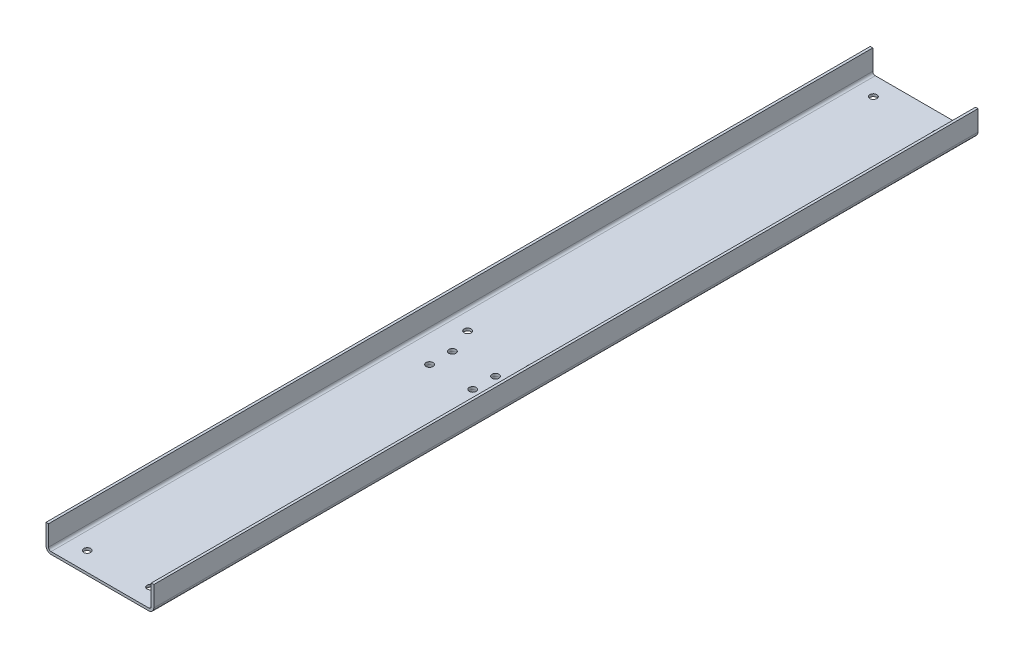
ISO-10303-21;
HEADER;
FILE_DESCRIPTION(('STEP AP214'),'2;1');
FILE_NAME('part.step','',(''),(''),'','','');
FILE_SCHEMA(('AUTOMOTIVE_DESIGN { 1 0 10303 214 1 1 1 1 }'));
ENDSEC;
DATA;
#1=APPLICATION_CONTEXT('core data for automotive mechanical design processes');
#2=APPLICATION_PROTOCOL_DEFINITION('international standard','automotive_design',2000,#1);
#3=PRODUCT_CONTEXT('',#1,'mechanical');
#4=PRODUCT('Part','Part','',(#3));
#5=PRODUCT_RELATED_PRODUCT_CATEGORY('part','',(#4));
#6=PRODUCT_DEFINITION_FORMATION('','',#4);
#7=PRODUCT_DEFINITION_CONTEXT('part definition',#1,'design');
#8=PRODUCT_DEFINITION('design','',#6,#7);
#9=PRODUCT_DEFINITION_SHAPE('','',#8);
#10=(LENGTH_UNIT() NAMED_UNIT(*) SI_UNIT(.MILLI.,.METRE.));
#11=(NAMED_UNIT(*) PLANE_ANGLE_UNIT() SI_UNIT($,.RADIAN.));
#12=(NAMED_UNIT(*) SI_UNIT($,.STERADIAN.) SOLID_ANGLE_UNIT());
#13=UNCERTAINTY_MEASURE_WITH_UNIT(LENGTH_MEASURE(1.E-05),#10,'distance_accuracy_value','');
#14=(GEOMETRIC_REPRESENTATION_CONTEXT(3) GLOBAL_UNCERTAINTY_ASSIGNED_CONTEXT((#13)) GLOBAL_UNIT_ASSIGNED_CONTEXT((#10,
#11,#12)) REPRESENTATION_CONTEXT('',''));
#15=CARTESIAN_POINT('',(0.,0.,0.));
#16=DIRECTION('',(0.,0.,1.));
#17=DIRECTION('',(1.,0.,0.));
#18=AXIS2_PLACEMENT_3D('',#15,#16,#17);
#19=CARTESIAN_POINT('',(23.,-6.,379.));
#20=DIRECTION('',(-1.,0.,0.));
#21=DIRECTION('',(0.,-1.,0.));
#22=AXIS2_PLACEMENT_3D('',#19,#20,#21);
#23=PLANE('',#22);
#24=DIRECTION('',(0.,0.,1.));
#25=VECTOR('',#24,1.);
#26=CARTESIAN_POINT('',(23.,-6.,379.));
#27=LINE('',#26,#25);
#28=CARTESIAN_POINT('',(23.,-6.,352.));
#29=VERTEX_POINT('',#28);
#30=CARTESIAN_POINT('',(23.,-6.,376.));
#31=VERTEX_POINT('',#30);
#32=EDGE_CURVE('E143',#29,#31,#27,.T.);
#33=ORIENTED_EDGE('',*,*,#32,.F.);
#34=DIRECTION('',(0.,1.,0.));
#35=VECTOR('',#34,1.);
#36=CARTESIAN_POINT('',(23.,-6.,352.));
#37=LINE('',#36,#35);
#38=CARTESIAN_POINT('',(23.,0.,352.));
#39=VERTEX_POINT('',#38);
#40=EDGE_CURVE('E12',#29,#39,#37,.T.);
#41=ORIENTED_EDGE('',*,*,#40,.T.);
#42=DIRECTION('',(0.,0.,1.));
#43=VECTOR('',#42,1.);
#44=CARTESIAN_POINT('',(23.,0.,379.));
#45=LINE('',#44,#43);
#46=CARTESIAN_POINT('',(23.,0.,376.));
#47=VERTEX_POINT('',#46);
#48=EDGE_CURVE('E194',#39,#47,#45,.T.);
#49=ORIENTED_EDGE('',*,*,#48,.T.);
#50=DIRECTION('',(0.,-1.,0.));
#51=VECTOR('',#50,1.);
#52=CARTESIAN_POINT('',(23.,-6.,376.));
#53=LINE('',#52,#51);
#54=EDGE_CURVE('E56',#47,#31,#53,.T.);
#55=ORIENTED_EDGE('',*,*,#54,.T.);
#56=EDGE_LOOP('',(#33,#41,#49,#55));
#57=FACE_BOUND('',#56,.T.);
#58=ADVANCED_FACE('F47',(#57),#23,.F.);
#59=CARTESIAN_POINT('',(23.,-6.,379.));
#60=DIRECTION('',(0.,0.,-1.));
#61=DIRECTION('',(-1.,0.,0.));
#62=AXIS2_PLACEMENT_3D('',#59,#60,#61);
#63=PLANE('',#62);
#64=DIRECTION('',(-1.,0.,0.));
#65=VECTOR('',#64,1.);
#66=CARTESIAN_POINT('',(23.,0.,379.));
#67=LINE('',#66,#65);
#68=CARTESIAN_POINT('',(20.,0.,379.));
#69=VERTEX_POINT('',#68);
#70=CARTESIAN_POINT('',(-20.,0.,379.));
#71=VERTEX_POINT('',#70);
#72=EDGE_CURVE('E148',#69,#71,#67,.T.);
#73=ORIENTED_EDGE('',*,*,#72,.T.);
#74=DIRECTION('',(0.,-1.,0.));
#75=VECTOR('',#74,1.);
#76=CARTESIAN_POINT('',(-20.,-6.,379.));
#77=LINE('',#76,#75);
#78=CARTESIAN_POINT('',(-20.,-6.,379.));
#79=VERTEX_POINT('',#78);
#80=EDGE_CURVE('E64',#71,#79,#77,.T.);
#81=ORIENTED_EDGE('',*,*,#80,.T.);
#82=DIRECTION('',(-1.,0.,0.));
#83=VECTOR('',#82,1.);
#84=CARTESIAN_POINT('',(23.,-6.,379.));
#85=LINE('',#84,#83);
#86=CARTESIAN_POINT('',(20.,-6.,379.));
#87=VERTEX_POINT('',#86);
#88=EDGE_CURVE('E146',#87,#79,#85,.T.);
#89=ORIENTED_EDGE('',*,*,#88,.F.);
#90=DIRECTION('',(0.,1.,0.));
#91=VECTOR('',#90,1.);
#92=CARTESIAN_POINT('',(20.,-6.,379.));
#93=LINE('',#92,#91);
#94=EDGE_CURVE('E166',#87,#69,#93,.T.);
#95=ORIENTED_EDGE('',*,*,#94,.T.);
#96=EDGE_LOOP('',(#73,#81,#89,#95));
#97=FACE_BOUND('',#96,.T.);
#98=ADVANCED_FACE('F203',(#97),#63,.F.);
#99=CARTESIAN_POINT('',(-23.,-6.,379.));
#100=DIRECTION('',(1.,0.,0.));
#101=DIRECTION('',(0.,0.,-1.));
#102=AXIS2_PLACEMENT_3D('',#99,#100,#101);
#103=PLANE('',#102);
#104=DIRECTION('',(0.,0.,-1.));
#105=VECTOR('',#104,1.);
#106=CARTESIAN_POINT('',(-23.,0.,379.));
#107=LINE('',#106,#105);
#108=CARTESIAN_POINT('',(-23.,0.,376.));
#109=VERTEX_POINT('',#108);
#110=CARTESIAN_POINT('',(-23.,0.,352.));
#111=VERTEX_POINT('',#110);
#112=EDGE_CURVE('E144',#109,#111,#107,.T.);
#113=ORIENTED_EDGE('',*,*,#112,.T.);
#114=DIRECTION('',(0.,-1.,0.));
#115=VECTOR('',#114,1.);
#116=CARTESIAN_POINT('',(-23.,-6.,352.));
#117=LINE('',#116,#115);
#118=CARTESIAN_POINT('',(-23.,-6.,352.));
#119=VERTEX_POINT('',#118);
#120=EDGE_CURVE('E121',#111,#119,#117,.T.);
#121=ORIENTED_EDGE('',*,*,#120,.T.);
#122=DIRECTION('',(0.,0.,-1.));
#123=VECTOR('',#122,1.);
#124=CARTESIAN_POINT('',(-23.,-6.,379.));
#125=LINE('',#124,#123);
#126=CARTESIAN_POINT('',(-23.,-6.,376.));
#127=VERTEX_POINT('',#126);
#128=EDGE_CURVE('E197',#127,#119,#125,.T.);
#129=ORIENTED_EDGE('',*,*,#128,.F.);
#130=DIRECTION('',(0.,1.,0.));
#131=VECTOR('',#130,1.);
#132=CARTESIAN_POINT('',(-23.,-6.,376.));
#133=LINE('',#132,#131);
#134=EDGE_CURVE('E126',#127,#109,#133,.T.);
#135=ORIENTED_EDGE('',*,*,#134,.T.);
#136=EDGE_LOOP('',(#113,#121,#129,#135));
#137=FACE_BOUND('',#136,.T.);
#138=ADVANCED_FACE('F212',(#137),#103,.F.);
#139=CARTESIAN_POINT('',(23.,-6.,349.));
#140=DIRECTION('',(0.,0.,1.));
#141=DIRECTION('',(1.,0.,0.));
#142=AXIS2_PLACEMENT_3D('',#139,#140,#141);
#143=PLANE('',#142);
#144=DIRECTION('',(1.,0.,0.));
#145=VECTOR('',#144,1.);
#146=CARTESIAN_POINT('',(23.,-6.,349.));
#147=LINE('',#146,#145);
#148=CARTESIAN_POINT('',(-20.,-6.,349.));
#149=VERTEX_POINT('',#148);
#150=CARTESIAN_POINT('',(20.,-6.,349.));
#151=VERTEX_POINT('',#150);
#152=EDGE_CURVE('E136',#149,#151,#147,.T.);
#153=ORIENTED_EDGE('',*,*,#152,.F.);
#154=DIRECTION('',(0.,1.,0.));
#155=VECTOR('',#154,1.);
#156=CARTESIAN_POINT('',(-20.,-6.,349.));
#157=LINE('',#156,#155);
#158=CARTESIAN_POINT('',(-20.,0.,349.));
#159=VERTEX_POINT('',#158);
#160=EDGE_CURVE('E120',#149,#159,#157,.T.);
#161=ORIENTED_EDGE('',*,*,#160,.T.);
#162=DIRECTION('',(1.,0.,0.));
#163=VECTOR('',#162,1.);
#164=CARTESIAN_POINT('',(23.,0.,349.));
#165=LINE('',#164,#163);
#166=CARTESIAN_POINT('',(20.,0.,349.));
#167=VERTEX_POINT('',#166);
#168=EDGE_CURVE('E133',#159,#167,#165,.T.);
#169=ORIENTED_EDGE('',*,*,#168,.T.);
#170=DIRECTION('',(0.,-1.,0.));
#171=VECTOR('',#170,1.);
#172=CARTESIAN_POINT('',(20.,-6.,349.));
#173=LINE('',#172,#171);
#174=EDGE_CURVE('E138',#167,#151,#173,.T.);
#175=ORIENTED_EDGE('',*,*,#174,.T.);
#176=EDGE_LOOP('',(#153,#161,#169,#175));
#177=FACE_BOUND('',#176,.T.);
#178=ADVANCED_FACE('F132',(#177),#143,.F.);
#179=CARTESIAN_POINT('',(23.,-6.,349.));
#180=DIRECTION('',(0.,1.,0.));
#181=DIRECTION('',(-1.,0.,0.));
#182=AXIS2_PLACEMENT_3D('',#179,#180,#181);
#183=PLANE('',#182);
#184=CARTESIAN_POINT('',(17.,-6.,355.));
#185=DIRECTION('',(0.,1.,0.));
#186=DIRECTION('',(0.,0.,1.));
#187=AXIS2_PLACEMENT_3D('',#184,#185,#186);
#188=CIRCLE('',#187,2.75);
#189=CARTESIAN_POINT('',(17.,-6.,357.75));
#190=VERTEX_POINT('',#189);
#191=EDGE_CURVE('E184',#190,#190,#188,.T.);
#192=ORIENTED_EDGE('',*,*,#191,.T.);
#193=EDGE_LOOP('',(#192));
#194=FACE_BOUND('',#193,.T.);
#195=CARTESIAN_POINT('',(-17.,-6.00000000000001,355.));
#196=DIRECTION('',(0.,1.,0.));
#197=DIRECTION('',(0.,0.,1.));
#198=AXIS2_PLACEMENT_3D('',#195,#196,#197);
#199=CIRCLE('',#198,2.75);
#200=CARTESIAN_POINT('',(-17.,-6.00000000000001,357.75));
#201=VERTEX_POINT('',#200);
#202=EDGE_CURVE('E173',#201,#201,#199,.T.);
#203=ORIENTED_EDGE('',*,*,#202,.T.);
#204=EDGE_LOOP('',(#203));
#205=FACE_BOUND('',#204,.T.);
#206=CARTESIAN_POINT('',(-17.,-6.00000000000001,373.));
#207=DIRECTION('',(0.,1.,0.));
#208=DIRECTION('',(0.,0.,1.));
#209=AXIS2_PLACEMENT_3D('',#206,#207,#208);
#210=CIRCLE('',#209,2.75);
#211=CARTESIAN_POINT('',(-17.,-6.00000000000001,375.75));
#212=VERTEX_POINT('',#211);
#213=EDGE_CURVE('E172',#212,#212,#210,.T.);
#214=ORIENTED_EDGE('',*,*,#213,.T.);
#215=EDGE_LOOP('',(#214));
#216=FACE_BOUND('',#215,.T.);
#217=CARTESIAN_POINT('',(17.,-6.,373.));
#218=DIRECTION('',(0.,1.,0.));
#219=DIRECTION('',(0.,0.,1.));
#220=AXIS2_PLACEMENT_3D('',#217,#218,#219);
#221=CIRCLE('',#220,2.75);
#222=CARTESIAN_POINT('',(17.,-6.,375.75));
#223=VERTEX_POINT('',#222);
#224=EDGE_CURVE('E189',#223,#223,#221,.T.);
#225=ORIENTED_EDGE('',*,*,#224,.T.);
#226=EDGE_LOOP('',(#225));
#227=FACE_BOUND('',#226,.T.);
#228=ORIENTED_EDGE('',*,*,#128,.T.);
#229=DIRECTION('',(-0.707106781186543,0.,0.707106781186552));
#230=VECTOR('',#229,1.);
#231=CARTESIAN_POINT('',(-20.,-6.,349.));
#232=LINE('',#231,#230);
#233=EDGE_CURVE('E164',#119,#149,#232,.F.);
#234=ORIENTED_EDGE('',*,*,#233,.T.);
#235=ORIENTED_EDGE('',*,*,#152,.T.);
#236=DIRECTION('',(-0.707106781186545,0.,-0.70710678118655));
#237=VECTOR('',#236,1.);
#238=CARTESIAN_POINT('',(23.,-6.,352.));
#239=LINE('',#238,#237);
#240=EDGE_CURVE('E160',#151,#29,#239,.F.);
#241=ORIENTED_EDGE('',*,*,#240,.T.);
#242=ORIENTED_EDGE('',*,*,#32,.T.);
#243=DIRECTION('',(0.707106781186548,0.,-0.707106781186547));
#244=VECTOR('',#243,1.);
#245=CARTESIAN_POINT('',(20.,-6.,379.));
#246=LINE('',#245,#244);
#247=EDGE_CURVE('E71',#31,#87,#246,.F.);
#248=ORIENTED_EDGE('',*,*,#247,.T.);
#249=ORIENTED_EDGE('',*,*,#88,.T.);
#250=DIRECTION('',(0.707106781186545,0.,0.70710678118655));
#251=VECTOR('',#250,1.);
#252=CARTESIAN_POINT('',(-23.,-6.,376.));
#253=LINE('',#252,#251);
#254=EDGE_CURVE('E162',#79,#127,#253,.F.);
#255=ORIENTED_EDGE('',*,*,#254,.T.);
#256=EDGE_LOOP('',(#228,#234,#235,#241,#242,#248,#249,#255));
#257=FACE_BOUND('',#256,.T.);
#258=ADVANCED_FACE('F210',(#194,#205,#216,#227,#257),#183,.F.);
#259=CARTESIAN_POINT('',(23.,0.,349.));
#260=DIRECTION('',(0.,1.,0.));
#261=DIRECTION('',(-1.,0.,0.));
#262=AXIS2_PLACEMENT_3D('',#259,#260,#261);
#263=PLANE('',#262);
#264=CARTESIAN_POINT('',(17.,0.,355.));
#265=DIRECTION('',(0.,1.,0.));
#266=DIRECTION('',(-1.,0.,0.));
#267=AXIS2_PLACEMENT_3D('',#264,#265,#266);
#268=CIRCLE('',#267,2.74999999999999);
#269=CARTESIAN_POINT('',(14.25,0.,355.));
#270=VERTEX_POINT('',#269);
#271=EDGE_CURVE('E51',#270,#270,#268,.T.);
#272=ORIENTED_EDGE('',*,*,#271,.F.);
#273=EDGE_LOOP('',(#272));
#274=FACE_BOUND('',#273,.T.);
#275=CARTESIAN_POINT('',(-17.,0.,355.));
#276=DIRECTION('',(0.,1.,0.));
#277=DIRECTION('',(-1.,0.,0.));
#278=AXIS2_PLACEMENT_3D('',#275,#276,#277);
#279=CIRCLE('',#278,2.74999999999999);
#280=CARTESIAN_POINT('',(-19.75,0.,355.));
#281=VERTEX_POINT('',#280);
#282=EDGE_CURVE('E170',#281,#281,#279,.T.);
#283=ORIENTED_EDGE('',*,*,#282,.F.);
#284=EDGE_LOOP('',(#283));
#285=FACE_BOUND('',#284,.T.);
#286=CARTESIAN_POINT('',(-17.,0.,373.));
#287=DIRECTION('',(0.,1.,0.));
#288=DIRECTION('',(-1.,0.,0.));
#289=AXIS2_PLACEMENT_3D('',#286,#287,#288);
#290=CIRCLE('',#289,2.74999999999999);
#291=CARTESIAN_POINT('',(-19.75,0.,373.));
#292=VERTEX_POINT('',#291);
#293=EDGE_CURVE('E177',#292,#292,#290,.T.);
#294=ORIENTED_EDGE('',*,*,#293,.F.);
#295=EDGE_LOOP('',(#294));
#296=FACE_BOUND('',#295,.T.);
#297=CARTESIAN_POINT('',(17.,0.,373.));
#298=DIRECTION('',(0.,1.,0.));
#299=DIRECTION('',(-1.,0.,0.));
#300=AXIS2_PLACEMENT_3D('',#297,#298,#299);
#301=CIRCLE('',#300,2.74999999999999);
#302=CARTESIAN_POINT('',(14.25,0.,373.));
#303=VERTEX_POINT('',#302);
#304=EDGE_CURVE('E192',#303,#303,#301,.T.);
#305=ORIENTED_EDGE('',*,*,#304,.F.);
#306=EDGE_LOOP('',(#305));
#307=FACE_BOUND('',#306,.T.);
#308=ORIENTED_EDGE('',*,*,#168,.F.);
#309=DIRECTION('',(0.707106781186543,0.,-0.707106781186552));
#310=VECTOR('',#309,1.);
#311=CARTESIAN_POINT('',(1.49999999999974,0.,327.5));
#312=LINE('',#311,#310);
#313=EDGE_CURVE('E116',#159,#111,#312,.F.);
#314=ORIENTED_EDGE('',*,*,#313,.T.);
#315=ORIENTED_EDGE('',*,*,#112,.F.);
#316=DIRECTION('',(-0.707106781186545,0.,-0.70710678118655));
#317=VECTOR('',#316,1.);
#318=CARTESIAN_POINT('',(-13.5000000000001,0.,385.5));
#319=LINE('',#318,#317);
#320=EDGE_CURVE('E127',#109,#71,#319,.F.);
#321=ORIENTED_EDGE('',*,*,#320,.T.);
#322=ORIENTED_EDGE('',*,*,#72,.F.);
#323=DIRECTION('',(-0.707106781186548,0.,0.707106781186547));
#324=VECTOR('',#323,1.);
#325=CARTESIAN_POINT('',(36.5,0.,362.5));
#326=LINE('',#325,#324);
#327=EDGE_CURVE('E137',#69,#47,#326,.F.);
#328=ORIENTED_EDGE('',*,*,#327,.T.);
#329=ORIENTED_EDGE('',*,*,#48,.F.);
#330=DIRECTION('',(0.707106781186545,0.,0.70710678118655));
#331=VECTOR('',#330,1.);
#332=CARTESIAN_POINT('',(21.5,0.,350.5));
#333=LINE('',#332,#331);
#334=EDGE_CURVE('E142',#39,#167,#333,.F.);
#335=ORIENTED_EDGE('',*,*,#334,.T.);
#336=EDGE_LOOP('',(#308,#314,#315,#321,#322,#328,#329,#335));
#337=FACE_BOUND('',#336,.T.);
#338=ADVANCED_FACE('F140',(#274,#285,#296,#307,#337),#263,.T.);
#339=CARTESIAN_POINT('',(-20.,-6.,349.));
#340=DIRECTION('',(0.707106781186552,0.,0.707106781186543));
#341=DIRECTION('',(0.707106781186543,0.,-0.707106781186552));
#342=AXIS2_PLACEMENT_3D('',#339,#340,#341);
#343=PLANE('',#342);
#344=ORIENTED_EDGE('',*,*,#233,.F.);
#345=ORIENTED_EDGE('',*,*,#120,.F.);
#346=ORIENTED_EDGE('',*,*,#313,.F.);
#347=ORIENTED_EDGE('',*,*,#160,.F.);
#348=EDGE_LOOP('',(#344,#345,#346,#347));
#349=FACE_BOUND('',#348,.T.);
#350=ADVANCED_FACE('F119',(#349),#343,.F.);
#351=CARTESIAN_POINT('',(-23.,-6.,376.));
#352=DIRECTION('',(0.70710678118655,0.,-0.707106781186545));
#353=DIRECTION('',(-0.707106781186545,0.,-0.70710678118655));
#354=AXIS2_PLACEMENT_3D('',#351,#352,#353);
#355=PLANE('',#354);
#356=ORIENTED_EDGE('',*,*,#254,.F.);
#357=ORIENTED_EDGE('',*,*,#80,.F.);
#358=ORIENTED_EDGE('',*,*,#320,.F.);
#359=ORIENTED_EDGE('',*,*,#134,.F.);
#360=EDGE_LOOP('',(#356,#357,#358,#359));
#361=FACE_BOUND('',#360,.T.);
#362=ADVANCED_FACE('F207',(#361),#355,.F.);
#363=CARTESIAN_POINT('',(23.,-6.,352.));
#364=DIRECTION('',(-0.70710678118655,0.,0.707106781186545));
#365=DIRECTION('',(0.707106781186545,0.,0.70710678118655));
#366=AXIS2_PLACEMENT_3D('',#363,#364,#365);
#367=PLANE('',#366);
#368=ORIENTED_EDGE('',*,*,#240,.F.);
#369=ORIENTED_EDGE('',*,*,#174,.F.);
#370=ORIENTED_EDGE('',*,*,#334,.F.);
#371=ORIENTED_EDGE('',*,*,#40,.F.);
#372=EDGE_LOOP('',(#368,#369,#370,#371));
#373=FACE_BOUND('',#372,.T.);
#374=ADVANCED_FACE('F231',(#373),#367,.F.);
#375=CARTESIAN_POINT('',(20.,-6.,379.));
#376=DIRECTION('',(-0.707106781186547,0.,-0.707106781186548));
#377=DIRECTION('',(-0.707106781186548,0.,0.707106781186547));
#378=AXIS2_PLACEMENT_3D('',#375,#376,#377);
#379=PLANE('',#378);
#380=ORIENTED_EDGE('',*,*,#247,.F.);
#381=ORIENTED_EDGE('',*,*,#54,.F.);
#382=ORIENTED_EDGE('',*,*,#327,.F.);
#383=ORIENTED_EDGE('',*,*,#94,.F.);
#384=EDGE_LOOP('',(#380,#381,#382,#383));
#385=FACE_BOUND('',#384,.T.);
#386=ADVANCED_FACE('F49',(#385),#379,.F.);
#387=CARTESIAN_POINT('',(17.,2.00000000000001,373.));
#388=DIRECTION('',(0.,1.,0.));
#389=DIRECTION('',(0.,0.,1.));
#390=AXIS2_PLACEMENT_3D('',#387,#388,#389);
#391=CYLINDRICAL_SURFACE('',#390,2.74999999999999);
#392=ORIENTED_EDGE('',*,*,#304,.T.);
#393=EDGE_LOOP('',(#392));
#394=FACE_BOUND('',#393,.T.);
#395=ORIENTED_EDGE('',*,*,#224,.F.);
#396=EDGE_LOOP('',(#395));
#397=FACE_BOUND('',#396,.T.);
#398=ADVANCED_FACE('F237',(#394,#397),#391,.F.);
#399=CARTESIAN_POINT('',(-17.,2.,373.));
#400=DIRECTION('',(0.,1.,0.));
#401=DIRECTION('',(0.,0.,1.));
#402=AXIS2_PLACEMENT_3D('',#399,#400,#401);
#403=CYLINDRICAL_SURFACE('',#402,2.74999999999999);
#404=ORIENTED_EDGE('',*,*,#293,.T.);
#405=EDGE_LOOP('',(#404));
#406=FACE_BOUND('',#405,.T.);
#407=ORIENTED_EDGE('',*,*,#213,.F.);
#408=EDGE_LOOP('',(#407));
#409=FACE_BOUND('',#408,.T.);
#410=ADVANCED_FACE('F246',(#406,#409),#403,.F.);
#411=CARTESIAN_POINT('',(-17.,2.,355.));
#412=DIRECTION('',(0.,1.,0.));
#413=DIRECTION('',(0.,0.,1.));
#414=AXIS2_PLACEMENT_3D('',#411,#412,#413);
#415=CYLINDRICAL_SURFACE('',#414,2.74999999999999);
#416=ORIENTED_EDGE('',*,*,#282,.T.);
#417=EDGE_LOOP('',(#416));
#418=FACE_BOUND('',#417,.T.);
#419=ORIENTED_EDGE('',*,*,#202,.F.);
#420=EDGE_LOOP('',(#419));
#421=FACE_BOUND('',#420,.T.);
#422=ADVANCED_FACE('F253',(#418,#421),#415,.F.);
#423=CARTESIAN_POINT('',(17.,2.00000000000001,355.));
#424=DIRECTION('',(0.,1.,0.));
#425=DIRECTION('',(0.,0.,1.));
#426=AXIS2_PLACEMENT_3D('',#423,#424,#425);
#427=CYLINDRICAL_SURFACE('',#426,2.74999999999999);
#428=ORIENTED_EDGE('',*,*,#271,.T.);
#429=EDGE_LOOP('',(#428));
#430=FACE_BOUND('',#429,.T.);
#431=ORIENTED_EDGE('',*,*,#191,.F.);
#432=EDGE_LOOP('',(#431));
#433=FACE_BOUND('',#432,.T.);
#434=ADVANCED_FACE('F276',(#430,#433),#427,.F.);
#435=CLOSED_SHELL('',(#58,#98,#138,#178,#258,#338,#350,#362,#374,#386,#398,#410,#422,#434));
#436=MANIFOLD_SOLID_BREP('B2',#435);
#437=CARTESIAN_POINT('',(42.5,0.,650.));
#438=DIRECTION('',(-1.,0.,0.));
#439=DIRECTION('',(0.,-1.,0.));
#440=AXIS2_PLACEMENT_3D('',#437,#438,#439);
#441=PLANE('',#440);
#442=DIRECTION('',(0.,1.,0.));
#443=VECTOR('',#442,1.);
#444=CARTESIAN_POINT('',(42.5,0.,650.));
#445=LINE('',#444,#443);
#446=CARTESIAN_POINT('',(42.5,4.00000000000001,650.));
#447=VERTEX_POINT('',#446);
#448=CARTESIAN_POINT('',(42.5,20.,650.));
#449=VERTEX_POINT('',#448);
#450=EDGE_CURVE('E423',#447,#449,#445,.T.);
#451=ORIENTED_EDGE('',*,*,#450,.F.);
#452=DIRECTION('',(0.,0.,-1.));
#453=VECTOR('',#452,1.);
#454=CARTESIAN_POINT('',(42.5,4.00000000000001,650.));
#455=LINE('',#454,#453);
#456=CARTESIAN_POINT('',(42.5,4.00000000000001,0.));
#457=VERTEX_POINT('',#456);
#458=EDGE_CURVE('E471',#447,#457,#455,.T.);
#459=ORIENTED_EDGE('',*,*,#458,.T.);
#460=DIRECTION('',(0.,1.,0.));
#461=VECTOR('',#460,1.);
#462=CARTESIAN_POINT('',(42.5,0.,0.));
#463=LINE('',#462,#461);
#464=CARTESIAN_POINT('',(42.5,20.,0.));
#465=VERTEX_POINT('',#464);
#466=EDGE_CURVE('E446',#457,#465,#463,.T.);
#467=ORIENTED_EDGE('',*,*,#466,.T.);
#468=DIRECTION('',(0.,0.,-1.));
#469=VECTOR('',#468,1.);
#470=CARTESIAN_POINT('',(42.5,20.,650.));
#471=LINE('',#470,#469);
#472=EDGE_CURVE('E439',#449,#465,#471,.T.);
#473=ORIENTED_EDGE('',*,*,#472,.F.);
#474=EDGE_LOOP('',(#451,#459,#467,#473));
#475=FACE_BOUND('',#474,.T.);
#476=ADVANCED_FACE('F331',(#475),#441,.F.);
#477=CARTESIAN_POINT('',(40.5,20.,650.));
#478=DIRECTION('',(0.,-1.,0.));
#479=DIRECTION('',(1.,0.,0.));
#480=AXIS2_PLACEMENT_3D('',#477,#478,#479);
#481=PLANE('',#480);
#482=DIRECTION('',(-1.,0.,0.));
#483=VECTOR('',#482,1.);
#484=CARTESIAN_POINT('',(40.5,20.,0.));
#485=LINE('',#484,#483);
#486=CARTESIAN_POINT('',(40.5,20.,0.));
#487=VERTEX_POINT('',#486);
#488=EDGE_CURVE('E554',#465,#487,#485,.T.);
#489=ORIENTED_EDGE('',*,*,#488,.T.);
#490=DIRECTION('',(0.,0.,-1.));
#491=VECTOR('',#490,1.);
#492=CARTESIAN_POINT('',(40.5,20.,650.));
#493=LINE('',#492,#491);
#494=CARTESIAN_POINT('',(40.5,20.,650.));
#495=VERTEX_POINT('',#494);
#496=EDGE_CURVE('E441',#495,#487,#493,.T.);
#497=ORIENTED_EDGE('',*,*,#496,.F.);
#498=DIRECTION('',(-1.,0.,0.));
#499=VECTOR('',#498,1.);
#500=CARTESIAN_POINT('',(40.5,20.,650.));
#501=LINE('',#500,#499);
#502=EDGE_CURVE('E427',#449,#495,#501,.T.);
#503=ORIENTED_EDGE('',*,*,#502,.F.);
#504=ORIENTED_EDGE('',*,*,#472,.T.);
#505=EDGE_LOOP('',(#489,#497,#503,#504));
#506=FACE_BOUND('',#505,.T.);
#507=ADVANCED_FACE('F438',(#506),#481,.F.);
#508=CARTESIAN_POINT('',(40.5,2.00000000000001,650.));
#509=DIRECTION('',(1.,0.,0.));
#510=DIRECTION('',(0.,0.,-1.));
#511=AXIS2_PLACEMENT_3D('',#508,#509,#510);
#512=PLANE('',#511);
#513=DIRECTION('',(0.,-1.,0.));
#514=VECTOR('',#513,1.);
#515=CARTESIAN_POINT('',(40.5,2.00000000000001,0.));
#516=LINE('',#515,#514);
#517=CARTESIAN_POINT('',(40.5,4.00000000000001,0.));
#518=VERTEX_POINT('',#517);
#519=EDGE_CURVE('E556',#487,#518,#516,.T.);
#520=ORIENTED_EDGE('',*,*,#519,.T.);
#521=DIRECTION('',(0.,0.,-1.));
#522=VECTOR('',#521,1.);
#523=CARTESIAN_POINT('',(40.5,4.00000000000001,650.));
#524=LINE('',#523,#522);
#525=CARTESIAN_POINT('',(40.5,4.00000000000001,650.));
#526=VERTEX_POINT('',#525);
#527=EDGE_CURVE('E458',#518,#526,#524,.F.);
#528=ORIENTED_EDGE('',*,*,#527,.T.);
#529=DIRECTION('',(0.,-1.,0.));
#530=VECTOR('',#529,1.);
#531=CARTESIAN_POINT('',(40.5,2.00000000000001,650.));
#532=LINE('',#531,#530);
#533=EDGE_CURVE('E443',#495,#526,#532,.T.);
#534=ORIENTED_EDGE('',*,*,#533,.F.);
#535=ORIENTED_EDGE('',*,*,#496,.T.);
#536=EDGE_LOOP('',(#520,#528,#534,#535));
#537=FACE_BOUND('',#536,.T.);
#538=ADVANCED_FACE('F608',(#537),#512,.F.);
#539=CARTESIAN_POINT('',(-40.5,2.,650.));
#540=DIRECTION('',(0.,-1.,0.));
#541=DIRECTION('',(1.,0.,0.));
#542=AXIS2_PLACEMENT_3D('',#539,#540,#541);
#543=PLANE('',#542);
#544=CARTESIAN_POINT('',(17.,2.00000000000001,355.));
#545=DIRECTION('',(0.,1.,0.));
#546=DIRECTION('',(0.,0.,1.));
#547=AXIS2_PLACEMENT_3D('',#544,#545,#546);
#548=CIRCLE('',#547,2.74999999999999);
#549=CARTESIAN_POINT('',(17.,2.00000000000001,357.75));
#550=VERTEX_POINT('',#549);
#551=EDGE_CURVE('E772',#550,#550,#548,.T.);
#552=ORIENTED_EDGE('',*,*,#551,.F.);
#553=EDGE_LOOP('',(#552));
#554=FACE_BOUND('',#553,.T.);
#555=CARTESIAN_POINT('',(-17.,2.,355.));
#556=DIRECTION('',(0.,1.,0.));
#557=DIRECTION('',(0.,0.,1.));
#558=AXIS2_PLACEMENT_3D('',#555,#556,#557);
#559=CIRCLE('',#558,2.74999999999999);
#560=CARTESIAN_POINT('',(-17.,2.,357.75));
#561=VERTEX_POINT('',#560);
#562=EDGE_CURVE('E498',#561,#561,#559,.T.);
#563=ORIENTED_EDGE('',*,*,#562,.F.);
#564=EDGE_LOOP('',(#563));
#565=FACE_BOUND('',#564,.T.);
#566=CARTESIAN_POINT('',(-17.,2.,373.));
#567=DIRECTION('',(0.,1.,0.));
#568=DIRECTION('',(0.,0.,1.));
#569=AXIS2_PLACEMENT_3D('',#566,#567,#568);
#570=CIRCLE('',#569,2.74999999999999);
#571=CARTESIAN_POINT('',(-17.,2.,375.75));
#572=VERTEX_POINT('',#571);
#573=EDGE_CURVE('E486',#572,#572,#570,.T.);
#574=ORIENTED_EDGE('',*,*,#573,.F.);
#575=EDGE_LOOP('',(#574));
#576=FACE_BOUND('',#575,.T.);
#577=CARTESIAN_POINT('',(17.,2.00000000000001,373.));
#578=DIRECTION('',(0.,1.,0.));
#579=DIRECTION('',(0.,0.,1.));
#580=AXIS2_PLACEMENT_3D('',#577,#578,#579);
#581=CIRCLE('',#580,2.74999999999999);
#582=CARTESIAN_POINT('',(17.,2.00000000000001,375.75));
#583=VERTEX_POINT('',#582);
#584=EDGE_CURVE('E485',#583,#583,#581,.T.);
#585=ORIENTED_EDGE('',*,*,#584,.F.);
#586=EDGE_LOOP('',(#585));
#587=FACE_BOUND('',#586,.T.);
#588=CARTESIAN_POINT('',(-25.,2.,15.));
#589=DIRECTION('',(0.,1.,0.));
#590=DIRECTION('',(0.,0.,1.));
#591=AXIS2_PLACEMENT_3D('',#588,#589,#590);
#592=CIRCLE('',#591,2.75);
#593=CARTESIAN_POINT('',(-25.,2.,17.75));
#594=VERTEX_POINT('',#593);
#595=EDGE_CURVE('E504',#594,#594,#592,.T.);
#596=ORIENTED_EDGE('',*,*,#595,.F.);
#597=EDGE_LOOP('',(#596));
#598=FACE_BOUND('',#597,.T.);
#599=CARTESIAN_POINT('',(-25.,2.,635.));
#600=DIRECTION('',(0.,1.,0.));
#601=DIRECTION('',(0.,0.,1.));
#602=AXIS2_PLACEMENT_3D('',#599,#600,#601);
#603=CIRCLE('',#602,2.75);
#604=CARTESIAN_POINT('',(-25.,2.,637.75));
#605=VERTEX_POINT('',#604);
#606=EDGE_CURVE('E510',#605,#605,#603,.T.);
#607=ORIENTED_EDGE('',*,*,#606,.F.);
#608=EDGE_LOOP('',(#607));
#609=FACE_BOUND('',#608,.T.);
#610=CARTESIAN_POINT('',(25.,2.00000000000001,15.));
#611=DIRECTION('',(0.,1.,0.));
#612=DIRECTION('',(0.,0.,1.));
#613=AXIS2_PLACEMENT_3D('',#610,#611,#612);
#614=CIRCLE('',#613,2.75);
#615=CARTESIAN_POINT('',(25.,2.00000000000001,17.75));
#616=VERTEX_POINT('',#615);
#617=EDGE_CURVE('E516',#616,#616,#614,.T.);
#618=ORIENTED_EDGE('',*,*,#617,.F.);
#619=EDGE_LOOP('',(#618));
#620=FACE_BOUND('',#619,.T.);
#621=CARTESIAN_POINT('',(25.,2.00000000000001,335.));
#622=DIRECTION('',(0.,1.,0.));
#623=DIRECTION('',(0.,0.,1.));
#624=AXIS2_PLACEMENT_3D('',#621,#622,#623);
#625=CIRCLE('',#624,2.75);
#626=CARTESIAN_POINT('',(25.,2.00000000000001,337.75));
#627=VERTEX_POINT('',#626);
#628=EDGE_CURVE('E522',#627,#627,#625,.T.);
#629=ORIENTED_EDGE('',*,*,#628,.F.);
#630=EDGE_LOOP('',(#629));
#631=FACE_BOUND('',#630,.T.);
#632=CARTESIAN_POINT('',(-25.,2.,335.));
#633=DIRECTION('',(0.,1.,0.));
#634=DIRECTION('',(0.,0.,1.));
#635=AXIS2_PLACEMENT_3D('',#632,#633,#634);
#636=CIRCLE('',#635,2.75);
#637=CARTESIAN_POINT('',(-25.,2.,337.75));
#638=VERTEX_POINT('',#637);
#639=EDGE_CURVE('E528',#638,#638,#636,.T.);
#640=ORIENTED_EDGE('',*,*,#639,.F.);
#641=EDGE_LOOP('',(#640));
#642=FACE_BOUND('',#641,.T.);
#643=CARTESIAN_POINT('',(25.,2.00000000000001,635.));
#644=DIRECTION('',(0.,1.,0.));
#645=DIRECTION('',(0.,0.,1.));
#646=AXIS2_PLACEMENT_3D('',#643,#644,#645);
#647=CIRCLE('',#646,2.75);
#648=CARTESIAN_POINT('',(25.,2.00000000000001,637.75));
#649=VERTEX_POINT('',#648);
#650=EDGE_CURVE('E534',#649,#649,#647,.T.);
#651=ORIENTED_EDGE('',*,*,#650,.F.);
#652=EDGE_LOOP('',(#651));
#653=FACE_BOUND('',#652,.T.);
#654=DIRECTION('',(-1.,0.,0.));
#655=VECTOR('',#654,1.);
#656=CARTESIAN_POINT('',(-40.5,2.,650.));
#657=LINE('',#656,#655);
#658=CARTESIAN_POINT('',(38.5,2.00000000000001,650.));
#659=VERTEX_POINT('',#658);
#660=CARTESIAN_POINT('',(-38.5,2.,650.));
#661=VERTEX_POINT('',#660);
#662=EDGE_CURVE('E541',#659,#661,#657,.T.);
#663=ORIENTED_EDGE('',*,*,#662,.F.);
#664=DIRECTION('',(0.,0.,-1.));
#665=VECTOR('',#664,1.);
#666=CARTESIAN_POINT('',(38.5,2.00000000000001,0.));
#667=LINE('',#666,#665);
#668=CARTESIAN_POINT('',(38.5,2.00000000000001,0.));
#669=VERTEX_POINT('',#668);
#670=EDGE_CURVE('E450',#659,#669,#667,.T.);
#671=ORIENTED_EDGE('',*,*,#670,.T.);
#672=DIRECTION('',(-1.,0.,0.));
#673=VECTOR('',#672,1.);
#674=CARTESIAN_POINT('',(-40.5,2.,0.));
#675=LINE('',#674,#673);
#676=CARTESIAN_POINT('',(-38.5,2.,0.));
#677=VERTEX_POINT('',#676);
#678=EDGE_CURVE('E559',#669,#677,#675,.T.);
#679=ORIENTED_EDGE('',*,*,#678,.T.);
#680=DIRECTION('',(0.,0.,-1.));
#681=VECTOR('',#680,1.);
#682=CARTESIAN_POINT('',(-38.5,2.,650.));
#683=LINE('',#682,#681);
#684=EDGE_CURVE('E448',#677,#661,#683,.F.);
#685=ORIENTED_EDGE('',*,*,#684,.T.);
#686=EDGE_LOOP('',(#663,#671,#679,#685));
#687=FACE_BOUND('',#686,.T.);
#688=ADVANCED_FACE('F624',(#554,#565,#576,#587,#598,#609,#620,#631,#642,#653,#687),#543,.F.);
#689=CARTESIAN_POINT('',(-40.5,2.,650.));
#690=DIRECTION('',(-1.,0.,0.));
#691=DIRECTION('',(0.,-1.,0.));
#692=AXIS2_PLACEMENT_3D('',#689,#690,#691);
#693=PLANE('',#692);
#694=DIRECTION('',(0.,1.,0.));
#695=VECTOR('',#694,1.);
#696=CARTESIAN_POINT('',(-40.5,2.,650.));
#697=LINE('',#696,#695);
#698=CARTESIAN_POINT('',(-40.5,4.,650.));
#699=VERTEX_POINT('',#698);
#700=CARTESIAN_POINT('',(-40.5,20.,650.));
#701=VERTEX_POINT('',#700);
#702=EDGE_CURVE('E544',#699,#701,#697,.T.);
#703=ORIENTED_EDGE('',*,*,#702,.F.);
#704=DIRECTION('',(0.,0.,-1.));
#705=VECTOR('',#704,1.);
#706=CARTESIAN_POINT('',(-40.5,4.,0.));
#707=LINE('',#706,#705);
#708=CARTESIAN_POINT('',(-40.5,4.,0.));
#709=VERTEX_POINT('',#708);
#710=EDGE_CURVE('E460',#699,#709,#707,.T.);
#711=ORIENTED_EDGE('',*,*,#710,.T.);
#712=DIRECTION('',(0.,1.,0.));
#713=VECTOR('',#712,1.);
#714=CARTESIAN_POINT('',(-40.5,2.,0.));
#715=LINE('',#714,#713);
#716=CARTESIAN_POINT('',(-40.5,20.,0.));
#717=VERTEX_POINT('',#716);
#718=EDGE_CURVE('E562',#709,#717,#715,.T.);
#719=ORIENTED_EDGE('',*,*,#718,.T.);
#720=DIRECTION('',(0.,0.,-1.));
#721=VECTOR('',#720,1.);
#722=CARTESIAN_POINT('',(-40.5,20.,650.));
#723=LINE('',#722,#721);
#724=EDGE_CURVE('E452',#701,#717,#723,.T.);
#725=ORIENTED_EDGE('',*,*,#724,.F.);
#726=EDGE_LOOP('',(#703,#711,#719,#725));
#727=FACE_BOUND('',#726,.T.);
#728=ADVANCED_FACE('F628',(#727),#693,.F.);
#729=CARTESIAN_POINT('',(-42.5,20.,650.));
#730=DIRECTION('',(0.,-1.,0.));
#731=DIRECTION('',(1.,0.,0.));
#732=AXIS2_PLACEMENT_3D('',#729,#730,#731);
#733=PLANE('',#732);
#734=DIRECTION('',(-1.,0.,0.));
#735=VECTOR('',#734,1.);
#736=CARTESIAN_POINT('',(-42.5,20.,0.));
#737=LINE('',#736,#735);
#738=CARTESIAN_POINT('',(-42.5,20.,0.));
#739=VERTEX_POINT('',#738);
#740=EDGE_CURVE('E564',#717,#739,#737,.T.);
#741=ORIENTED_EDGE('',*,*,#740,.T.);
#742=DIRECTION('',(0.,0.,-1.));
#743=VECTOR('',#742,1.);
#744=CARTESIAN_POINT('',(-42.5,20.,650.));
#745=LINE('',#744,#743);
#746=CARTESIAN_POINT('',(-42.5,20.,650.));
#747=VERTEX_POINT('',#746);
#748=EDGE_CURVE('E552',#747,#739,#745,.T.);
#749=ORIENTED_EDGE('',*,*,#748,.F.);
#750=DIRECTION('',(-1.,0.,0.));
#751=VECTOR('',#750,1.);
#752=CARTESIAN_POINT('',(-42.5,20.,650.));
#753=LINE('',#752,#751);
#754=EDGE_CURVE('E546',#701,#747,#753,.T.);
#755=ORIENTED_EDGE('',*,*,#754,.F.);
#756=ORIENTED_EDGE('',*,*,#724,.T.);
#757=EDGE_LOOP('',(#741,#749,#755,#756));
#758=FACE_BOUND('',#757,.T.);
#759=ADVANCED_FACE('F575',(#758),#733,.F.);
#760=CARTESIAN_POINT('',(-42.5,0.,650.));
#761=DIRECTION('',(1.,0.,0.));
#762=DIRECTION('',(0.,1.,0.));
#763=AXIS2_PLACEMENT_3D('',#760,#761,#762);
#764=PLANE('',#763);
#765=DIRECTION('',(0.,-1.,0.));
#766=VECTOR('',#765,1.);
#767=CARTESIAN_POINT('',(-42.5,0.,0.));
#768=LINE('',#767,#766);
#769=CARTESIAN_POINT('',(-42.5,4.,0.));
#770=VERTEX_POINT('',#769);
#771=EDGE_CURVE('E566',#739,#770,#768,.T.);
#772=ORIENTED_EDGE('',*,*,#771,.T.);
#773=DIRECTION('',(0.,0.,-1.));
#774=VECTOR('',#773,1.);
#775=CARTESIAN_POINT('',(-42.5,4.,650.));
#776=LINE('',#775,#774);
#777=CARTESIAN_POINT('',(-42.5,4.,650.));
#778=VERTEX_POINT('',#777);
#779=EDGE_CURVE('E45',#770,#778,#776,.F.);
#780=ORIENTED_EDGE('',*,*,#779,.T.);
#781=DIRECTION('',(0.,-1.,0.));
#782=VECTOR('',#781,1.);
#783=CARTESIAN_POINT('',(-42.5,0.,650.));
#784=LINE('',#783,#782);
#785=EDGE_CURVE('E548',#747,#778,#784,.T.);
#786=ORIENTED_EDGE('',*,*,#785,.F.);
#787=ORIENTED_EDGE('',*,*,#748,.T.);
#788=EDGE_LOOP('',(#772,#780,#786,#787));
#789=FACE_BOUND('',#788,.T.);
#790=ADVANCED_FACE('F584',(#789),#764,.F.);
#791=CARTESIAN_POINT('',(-42.5,0.,650.));
#792=DIRECTION('',(0.,1.,0.));
#793=DIRECTION('',(-1.,0.,0.));
#794=AXIS2_PLACEMENT_3D('',#791,#792,#793);
#795=PLANE('',#794);
#796=CARTESIAN_POINT('',(17.,0.,355.));
#797=DIRECTION('',(0.,1.,0.));
#798=DIRECTION('',(-1.,0.,0.));
#799=AXIS2_PLACEMENT_3D('',#796,#797,#798);
#800=CIRCLE('',#799,2.74999999999999);
#801=CARTESIAN_POINT('',(14.25,0.,355.));
#802=VERTEX_POINT('',#801);
#803=EDGE_CURVE('E335',#802,#802,#800,.T.);
#804=ORIENTED_EDGE('',*,*,#803,.T.);
#805=EDGE_LOOP('',(#804));
#806=FACE_BOUND('',#805,.T.);
#807=CARTESIAN_POINT('',(-17.,0.,355.));
#808=DIRECTION('',(0.,1.,0.));
#809=DIRECTION('',(-1.,0.,0.));
#810=AXIS2_PLACEMENT_3D('',#807,#808,#809);
#811=CIRCLE('',#810,2.74999999999999);
#812=CARTESIAN_POINT('',(-19.75,0.,355.));
#813=VERTEX_POINT('',#812);
#814=EDGE_CURVE('E493',#813,#813,#811,.T.);
#815=ORIENTED_EDGE('',*,*,#814,.T.);
#816=EDGE_LOOP('',(#815));
#817=FACE_BOUND('',#816,.T.);
#818=CARTESIAN_POINT('',(-17.,0.,373.));
#819=DIRECTION('',(0.,1.,0.));
#820=DIRECTION('',(-1.,0.,0.));
#821=AXIS2_PLACEMENT_3D('',#818,#819,#820);
#822=CIRCLE('',#821,2.74999999999999);
#823=CARTESIAN_POINT('',(-19.75,0.,373.));
#824=VERTEX_POINT('',#823);
#825=EDGE_CURVE('E483',#824,#824,#822,.T.);
#826=ORIENTED_EDGE('',*,*,#825,.T.);
#827=EDGE_LOOP('',(#826));
#828=FACE_BOUND('',#827,.T.);
#829=CARTESIAN_POINT('',(17.,0.,373.));
#830=DIRECTION('',(0.,1.,0.));
#831=DIRECTION('',(-1.,0.,0.));
#832=AXIS2_PLACEMENT_3D('',#829,#830,#831);
#833=CIRCLE('',#832,2.74999999999999);
#834=CARTESIAN_POINT('',(14.25,0.,373.));
#835=VERTEX_POINT('',#834);
#836=EDGE_CURVE('E490',#835,#835,#833,.T.);
#837=ORIENTED_EDGE('',*,*,#836,.T.);
#838=EDGE_LOOP('',(#837));
#839=FACE_BOUND('',#838,.T.);
#840=CARTESIAN_POINT('',(-25.,0.,15.));
#841=DIRECTION('',(0.,1.,0.));
#842=DIRECTION('',(-1.,0.,0.));
#843=AXIS2_PLACEMENT_3D('',#840,#841,#842);
#844=CIRCLE('',#843,2.75);
#845=CARTESIAN_POINT('',(-27.75,0.,15.));
#846=VERTEX_POINT('',#845);
#847=EDGE_CURVE('E507',#846,#846,#844,.T.);
#848=ORIENTED_EDGE('',*,*,#847,.T.);
#849=EDGE_LOOP('',(#848));
#850=FACE_BOUND('',#849,.T.);
#851=CARTESIAN_POINT('',(-25.,0.,635.));
#852=DIRECTION('',(0.,1.,0.));
#853=DIRECTION('',(-1.,0.,0.));
#854=AXIS2_PLACEMENT_3D('',#851,#852,#853);
#855=CIRCLE('',#854,2.75);
#856=CARTESIAN_POINT('',(-27.75,0.,635.));
#857=VERTEX_POINT('',#856);
#858=EDGE_CURVE('E513',#857,#857,#855,.T.);
#859=ORIENTED_EDGE('',*,*,#858,.T.);
#860=EDGE_LOOP('',(#859));
#861=FACE_BOUND('',#860,.T.);
#862=CARTESIAN_POINT('',(25.,0.,15.));
#863=DIRECTION('',(0.,1.,0.));
#864=DIRECTION('',(-1.,0.,0.));
#865=AXIS2_PLACEMENT_3D('',#862,#863,#864);
#866=CIRCLE('',#865,2.75);
#867=CARTESIAN_POINT('',(22.25,0.,15.));
#868=VERTEX_POINT('',#867);
#869=EDGE_CURVE('E519',#868,#868,#866,.T.);
#870=ORIENTED_EDGE('',*,*,#869,.T.);
#871=EDGE_LOOP('',(#870));
#872=FACE_BOUND('',#871,.T.);
#873=CARTESIAN_POINT('',(25.,0.,335.));
#874=DIRECTION('',(0.,1.,0.));
#875=DIRECTION('',(-1.,0.,0.));
#876=AXIS2_PLACEMENT_3D('',#873,#874,#875);
#877=CIRCLE('',#876,2.75);
#878=CARTESIAN_POINT('',(22.25,0.,335.));
#879=VERTEX_POINT('',#878);
#880=EDGE_CURVE('E525',#879,#879,#877,.T.);
#881=ORIENTED_EDGE('',*,*,#880,.T.);
#882=EDGE_LOOP('',(#881));
#883=FACE_BOUND('',#882,.T.);
#884=CARTESIAN_POINT('',(-25.,0.,335.));
#885=DIRECTION('',(0.,1.,0.));
#886=DIRECTION('',(-1.,0.,0.));
#887=AXIS2_PLACEMENT_3D('',#884,#885,#886);
#888=CIRCLE('',#887,2.75);
#889=CARTESIAN_POINT('',(-27.75,0.,335.));
#890=VERTEX_POINT('',#889);
#891=EDGE_CURVE('E531',#890,#890,#888,.T.);
#892=ORIENTED_EDGE('',*,*,#891,.T.);
#893=EDGE_LOOP('',(#892));
#894=FACE_BOUND('',#893,.T.);
#895=CARTESIAN_POINT('',(25.,0.,635.));
#896=DIRECTION('',(0.,1.,0.));
#897=DIRECTION('',(-1.,0.,0.));
#898=AXIS2_PLACEMENT_3D('',#895,#896,#897);
#899=CIRCLE('',#898,2.75);
#900=CARTESIAN_POINT('',(22.25,0.,635.));
#901=VERTEX_POINT('',#900);
#902=EDGE_CURVE('E537',#901,#901,#899,.T.);
#903=ORIENTED_EDGE('',*,*,#902,.T.);
#904=EDGE_LOOP('',(#903));
#905=FACE_BOUND('',#904,.T.);
#906=DIRECTION('',(1.,0.,0.));
#907=VECTOR('',#906,1.);
#908=CARTESIAN_POINT('',(-42.5,0.,0.));
#909=LINE('',#908,#907);
#910=CARTESIAN_POINT('',(-38.5,0.,0.));
#911=VERTEX_POINT('',#910);
#912=CARTESIAN_POINT('',(38.5,0.,0.));
#913=VERTEX_POINT('',#912);
#914=EDGE_CURVE('E434',#911,#913,#909,.T.);
#915=ORIENTED_EDGE('',*,*,#914,.T.);
#916=DIRECTION('',(0.,0.,-1.));
#917=VECTOR('',#916,1.);
#918=CARTESIAN_POINT('',(38.5,0.,650.));
#919=LINE('',#918,#917);
#920=CARTESIAN_POINT('',(38.5,0.,650.));
#921=VERTEX_POINT('',#920);
#922=EDGE_CURVE('E354',#913,#921,#919,.F.);
#923=ORIENTED_EDGE('',*,*,#922,.T.);
#924=DIRECTION('',(1.,0.,0.));
#925=VECTOR('',#924,1.);
#926=CARTESIAN_POINT('',(-42.5,0.,650.));
#927=LINE('',#926,#925);
#928=CARTESIAN_POINT('',(-38.5,0.,650.));
#929=VERTEX_POINT('',#928);
#930=EDGE_CURVE('E550',#929,#921,#927,.T.);
#931=ORIENTED_EDGE('',*,*,#930,.F.);
#932=DIRECTION('',(0.,0.,-1.));
#933=VECTOR('',#932,1.);
#934=CARTESIAN_POINT('',(-38.5,0.,650.));
#935=LINE('',#934,#933);
#936=EDGE_CURVE('E477',#929,#911,#935,.T.);
#937=ORIENTED_EDGE('',*,*,#936,.T.);
#938=EDGE_LOOP('',(#915,#923,#931,#937));
#939=FACE_BOUND('',#938,.T.);
#940=ADVANCED_FACE('F588',(#806,#817,#828,#839,#850,#861,#872,#883,#894,#905,#939),#795,.F.);
#941=CARTESIAN_POINT('',(42.5,20.,650.));
#942=DIRECTION('',(0.,0.,-1.));
#943=DIRECTION('',(-1.,0.,0.));
#944=AXIS2_PLACEMENT_3D('',#941,#942,#943);
#945=PLANE('',#944);
#946=ORIENTED_EDGE('',*,*,#930,.T.);
#947=CARTESIAN_POINT('',(38.5,4.00000000000001,650.));
#948=DIRECTION('',(0.,0.,-1.));
#949=DIRECTION('',(-1.,0.,0.));
#950=AXIS2_PLACEMENT_3D('',#947,#948,#949);
#951=CIRCLE('',#950,4.);
#952=EDGE_CURVE('E340',#921,#447,#951,.F.);
#953=ORIENTED_EDGE('',*,*,#952,.T.);
#954=ORIENTED_EDGE('',*,*,#450,.T.);
#955=ORIENTED_EDGE('',*,*,#502,.T.);
#956=ORIENTED_EDGE('',*,*,#533,.T.);
#957=CARTESIAN_POINT('',(38.5,4.00000000000001,650.));
#958=DIRECTION('',(0.,0.,-1.));
#959=DIRECTION('',(-1.,0.,0.));
#960=AXIS2_PLACEMENT_3D('',#957,#958,#959);
#961=CIRCLE('',#960,2.);
#962=EDGE_CURVE('E465',#526,#659,#961,.T.);
#963=ORIENTED_EDGE('',*,*,#962,.T.);
#964=ORIENTED_EDGE('',*,*,#662,.T.);
#965=CARTESIAN_POINT('',(-38.5,4.,650.));
#966=DIRECTION('',(0.,0.,-1.));
#967=DIRECTION('',(-1.,0.,0.));
#968=AXIS2_PLACEMENT_3D('',#965,#966,#967);
#969=CIRCLE('',#968,2.);
#970=EDGE_CURVE('E469',#661,#699,#969,.T.);
#971=ORIENTED_EDGE('',*,*,#970,.T.);
#972=ORIENTED_EDGE('',*,*,#702,.T.);
#973=ORIENTED_EDGE('',*,*,#754,.T.);
#974=ORIENTED_EDGE('',*,*,#785,.T.);
#975=CARTESIAN_POINT('',(-38.5,4.,650.));
#976=DIRECTION('',(0.,0.,-1.));
#977=DIRECTION('',(-1.,0.,0.));
#978=AXIS2_PLACEMENT_3D('',#975,#976,#977);
#979=CIRCLE('',#978,4.);
#980=EDGE_CURVE('E481',#778,#929,#979,.F.);
#981=ORIENTED_EDGE('',*,*,#980,.T.);
#982=EDGE_LOOP('',(#946,#953,#954,#955,#956,#963,#964,#971,#972,#973,#974,#981));
#983=FACE_BOUND('',#982,.T.);
#984=ADVANCED_FACE('F425',(#983),#945,.F.);
#985=CARTESIAN_POINT('',(42.5,20.,0.));
#986=DIRECTION('',(0.,0.,-1.));
#987=DIRECTION('',(-1.,0.,0.));
#988=AXIS2_PLACEMENT_3D('',#985,#986,#987);
#989=PLANE('',#988);
#990=ORIENTED_EDGE('',*,*,#466,.F.);
#991=CARTESIAN_POINT('',(38.5,4.00000000000001,0.));
#992=DIRECTION('',(0.,0.,-1.));
#993=DIRECTION('',(-1.,0.,0.));
#994=AXIS2_PLACEMENT_3D('',#991,#992,#993);
#995=CIRCLE('',#994,4.);
#996=EDGE_CURVE('E475',#457,#913,#995,.T.);
#997=ORIENTED_EDGE('',*,*,#996,.T.);
#998=ORIENTED_EDGE('',*,*,#914,.F.);
#999=CARTESIAN_POINT('',(-38.5,4.,0.));
#1000=DIRECTION('',(0.,0.,-1.));
#1001=DIRECTION('',(-1.,0.,0.));
#1002=AXIS2_PLACEMENT_3D('',#999,#1000,#1001);
#1003=CIRCLE('',#1002,4.);
#1004=EDGE_CURVE('E473',#911,#770,#1003,.T.);
#1005=ORIENTED_EDGE('',*,*,#1004,.T.);
#1006=ORIENTED_EDGE('',*,*,#771,.F.);
#1007=ORIENTED_EDGE('',*,*,#740,.F.);
#1008=ORIENTED_EDGE('',*,*,#718,.F.);
#1009=CARTESIAN_POINT('',(-38.5,4.,0.));
#1010=DIRECTION('',(0.,0.,-1.));
#1011=DIRECTION('',(-1.,0.,0.));
#1012=AXIS2_PLACEMENT_3D('',#1009,#1010,#1011);
#1013=CIRCLE('',#1012,2.);
#1014=EDGE_CURVE('E467',#709,#677,#1013,.F.);
#1015=ORIENTED_EDGE('',*,*,#1014,.T.);
#1016=ORIENTED_EDGE('',*,*,#678,.F.);
#1017=CARTESIAN_POINT('',(38.5,4.00000000000001,0.));
#1018=DIRECTION('',(0.,0.,-1.));
#1019=DIRECTION('',(-1.,0.,0.));
#1020=AXIS2_PLACEMENT_3D('',#1017,#1018,#1019);
#1021=CIRCLE('',#1020,2.);
#1022=EDGE_CURVE('E463',#669,#518,#1021,.F.);
#1023=ORIENTED_EDGE('',*,*,#1022,.T.);
#1024=ORIENTED_EDGE('',*,*,#519,.F.);
#1025=ORIENTED_EDGE('',*,*,#488,.F.);
#1026=EDGE_LOOP('',(#990,#997,#998,#1005,#1006,#1007,#1008,#1015,#1016,#1023,#1024,#1025));
#1027=FACE_BOUND('',#1026,.T.);
#1028=ADVANCED_FACE('F582',(#1027),#989,.T.);
#1029=CARTESIAN_POINT('',(38.5,4.00000000000001,650.));
#1030=DIRECTION('',(0.,0.,1.));
#1031=DIRECTION('',(1.,0.,0.));
#1032=AXIS2_PLACEMENT_3D('',#1029,#1030,#1031);
#1033=CYLINDRICAL_SURFACE('',#1032,2.);
#1034=ORIENTED_EDGE('',*,*,#962,.F.);
#1035=ORIENTED_EDGE('',*,*,#527,.F.);
#1036=ORIENTED_EDGE('',*,*,#1022,.F.);
#1037=ORIENTED_EDGE('',*,*,#670,.F.);
#1038=EDGE_LOOP('',(#1034,#1035,#1036,#1037));
#1039=FACE_BOUND('',#1038,.T.);
#1040=ADVANCED_FACE('F599',(#1039),#1033,.F.);
#1041=CARTESIAN_POINT('',(-38.5,4.,650.));
#1042=DIRECTION('',(0.,0.,1.));
#1043=DIRECTION('',(1.,0.,0.));
#1044=AXIS2_PLACEMENT_3D('',#1041,#1042,#1043);
#1045=CYLINDRICAL_SURFACE('',#1044,2.);
#1046=ORIENTED_EDGE('',*,*,#970,.F.);
#1047=ORIENTED_EDGE('',*,*,#684,.F.);
#1048=ORIENTED_EDGE('',*,*,#1014,.F.);
#1049=ORIENTED_EDGE('',*,*,#710,.F.);
#1050=EDGE_LOOP('',(#1046,#1047,#1048,#1049));
#1051=FACE_BOUND('',#1050,.T.);
#1052=ADVANCED_FACE('F592',(#1051),#1045,.F.);
#1053=CARTESIAN_POINT('',(38.5,4.00000000000001,650.));
#1054=DIRECTION('',(0.,0.,-1.));
#1055=DIRECTION('',(-1.,0.,0.));
#1056=AXIS2_PLACEMENT_3D('',#1053,#1054,#1055);
#1057=CYLINDRICAL_SURFACE('',#1056,4.);
#1058=ORIENTED_EDGE('',*,*,#952,.F.);
#1059=ORIENTED_EDGE('',*,*,#922,.F.);
#1060=ORIENTED_EDGE('',*,*,#996,.F.);
#1061=ORIENTED_EDGE('',*,*,#458,.F.);
#1062=EDGE_LOOP('',(#1058,#1059,#1060,#1061));
#1063=FACE_BOUND('',#1062,.T.);
#1064=ADVANCED_FACE('F590',(#1063),#1057,.T.);
#1065=CARTESIAN_POINT('',(-38.5,4.,650.));
#1066=DIRECTION('',(0.,0.,-1.));
#1067=DIRECTION('',(-1.,0.,0.));
#1068=AXIS2_PLACEMENT_3D('',#1065,#1066,#1067);
#1069=CYLINDRICAL_SURFACE('',#1068,4.);
#1070=ORIENTED_EDGE('',*,*,#980,.F.);
#1071=ORIENTED_EDGE('',*,*,#779,.F.);
#1072=ORIENTED_EDGE('',*,*,#1004,.F.);
#1073=ORIENTED_EDGE('',*,*,#936,.F.);
#1074=EDGE_LOOP('',(#1070,#1071,#1072,#1073));
#1075=FACE_BOUND('',#1074,.T.);
#1076=ADVANCED_FACE('F333',(#1075),#1069,.T.);
#1077=CARTESIAN_POINT('',(25.,2.00000000000001,635.));
#1078=DIRECTION('',(0.,1.,0.));
#1079=DIRECTION('',(0.,0.,1.));
#1080=AXIS2_PLACEMENT_3D('',#1077,#1078,#1079);
#1081=CYLINDRICAL_SURFACE('',#1080,2.75);
#1082=ORIENTED_EDGE('',*,*,#650,.T.);
#1083=EDGE_LOOP('',(#1082));
#1084=FACE_BOUND('',#1083,.T.);
#1085=ORIENTED_EDGE('',*,*,#902,.F.);
#1086=EDGE_LOOP('',(#1085));
#1087=FACE_BOUND('',#1086,.T.);
#1088=ADVANCED_FACE('F597',(#1084,#1087),#1081,.F.);
#1089=CARTESIAN_POINT('',(-25.,2.,335.));
#1090=DIRECTION('',(0.,1.,0.));
#1091=DIRECTION('',(0.,0.,1.));
#1092=AXIS2_PLACEMENT_3D('',#1089,#1090,#1091);
#1093=CYLINDRICAL_SURFACE('',#1092,2.75);
#1094=ORIENTED_EDGE('',*,*,#639,.T.);
#1095=EDGE_LOOP('',(#1094));
#1096=FACE_BOUND('',#1095,.T.);
#1097=ORIENTED_EDGE('',*,*,#891,.F.);
#1098=EDGE_LOOP('',(#1097));
#1099=FACE_BOUND('',#1098,.T.);
#1100=ADVANCED_FACE('F697',(#1096,#1099),#1093,.F.);
#1101=CARTESIAN_POINT('',(25.,2.00000000000001,335.));
#1102=DIRECTION('',(0.,1.,0.));
#1103=DIRECTION('',(0.,0.,1.));
#1104=AXIS2_PLACEMENT_3D('',#1101,#1102,#1103);
#1105=CYLINDRICAL_SURFACE('',#1104,2.75);
#1106=ORIENTED_EDGE('',*,*,#628,.T.);
#1107=EDGE_LOOP('',(#1106));
#1108=FACE_BOUND('',#1107,.T.);
#1109=ORIENTED_EDGE('',*,*,#880,.F.);
#1110=EDGE_LOOP('',(#1109));
#1111=FACE_BOUND('',#1110,.T.);
#1112=ADVANCED_FACE('F705',(#1108,#1111),#1105,.F.);
#1113=CARTESIAN_POINT('',(25.,2.00000000000001,15.));
#1114=DIRECTION('',(0.,1.,0.));
#1115=DIRECTION('',(0.,0.,1.));
#1116=AXIS2_PLACEMENT_3D('',#1113,#1114,#1115);
#1117=CYLINDRICAL_SURFACE('',#1116,2.75);
#1118=ORIENTED_EDGE('',*,*,#617,.T.);
#1119=EDGE_LOOP('',(#1118));
#1120=FACE_BOUND('',#1119,.T.);
#1121=ORIENTED_EDGE('',*,*,#869,.F.);
#1122=EDGE_LOOP('',(#1121));
#1123=FACE_BOUND('',#1122,.T.);
#1124=ADVANCED_FACE('F713',(#1120,#1123),#1117,.F.);
#1125=CARTESIAN_POINT('',(-25.,2.,635.));
#1126=DIRECTION('',(0.,1.,0.));
#1127=DIRECTION('',(0.,0.,1.));
#1128=AXIS2_PLACEMENT_3D('',#1125,#1126,#1127);
#1129=CYLINDRICAL_SURFACE('',#1128,2.75);
#1130=ORIENTED_EDGE('',*,*,#606,.T.);
#1131=EDGE_LOOP('',(#1130));
#1132=FACE_BOUND('',#1131,.T.);
#1133=ORIENTED_EDGE('',*,*,#858,.F.);
#1134=EDGE_LOOP('',(#1133));
#1135=FACE_BOUND('',#1134,.T.);
#1136=ADVANCED_FACE('F721',(#1132,#1135),#1129,.F.);
#1137=CARTESIAN_POINT('',(-25.,2.,15.));
#1138=DIRECTION('',(0.,1.,0.));
#1139=DIRECTION('',(0.,0.,1.));
#1140=AXIS2_PLACEMENT_3D('',#1137,#1138,#1139);
#1141=CYLINDRICAL_SURFACE('',#1140,2.75);
#1142=ORIENTED_EDGE('',*,*,#595,.T.);
#1143=EDGE_LOOP('',(#1142));
#1144=FACE_BOUND('',#1143,.T.);
#1145=ORIENTED_EDGE('',*,*,#847,.F.);
#1146=EDGE_LOOP('',(#1145));
#1147=FACE_BOUND('',#1146,.T.);
#1148=ADVANCED_FACE('F729',(#1144,#1147),#1141,.F.);
#1149=CARTESIAN_POINT('',(17.,2.00000000000001,373.));
#1150=DIRECTION('',(0.,1.,0.));
#1151=DIRECTION('',(0.,0.,1.));
#1152=AXIS2_PLACEMENT_3D('',#1149,#1150,#1151);
#1153=CYLINDRICAL_SURFACE('',#1152,2.74999999999999);
#1154=ORIENTED_EDGE('',*,*,#584,.T.);
#1155=EDGE_LOOP('',(#1154));
#1156=FACE_BOUND('',#1155,.T.);
#1157=ORIENTED_EDGE('',*,*,#836,.F.);
#1158=EDGE_LOOP('',(#1157));
#1159=FACE_BOUND('',#1158,.T.);
#1160=ADVANCED_FACE('F737',(#1156,#1159),#1153,.F.);
#1161=CARTESIAN_POINT('',(-17.,2.,373.));
#1162=DIRECTION('',(0.,1.,0.));
#1163=DIRECTION('',(0.,0.,1.));
#1164=AXIS2_PLACEMENT_3D('',#1161,#1162,#1163);
#1165=CYLINDRICAL_SURFACE('',#1164,2.74999999999999);
#1166=ORIENTED_EDGE('',*,*,#573,.T.);
#1167=EDGE_LOOP('',(#1166));
#1168=FACE_BOUND('',#1167,.T.);
#1169=ORIENTED_EDGE('',*,*,#825,.F.);
#1170=EDGE_LOOP('',(#1169));
#1171=FACE_BOUND('',#1170,.T.);
#1172=ADVANCED_FACE('F744',(#1168,#1171),#1165,.F.);
#1173=CARTESIAN_POINT('',(-17.,2.,355.));
#1174=DIRECTION('',(0.,1.,0.));
#1175=DIRECTION('',(0.,0.,1.));
#1176=AXIS2_PLACEMENT_3D('',#1173,#1174,#1175);
#1177=CYLINDRICAL_SURFACE('',#1176,2.74999999999999);
#1178=ORIENTED_EDGE('',*,*,#562,.T.);
#1179=EDGE_LOOP('',(#1178));
#1180=FACE_BOUND('',#1179,.T.);
#1181=ORIENTED_EDGE('',*,*,#814,.F.);
#1182=EDGE_LOOP('',(#1181));
#1183=FACE_BOUND('',#1182,.T.);
#1184=ADVANCED_FACE('F752',(#1180,#1183),#1177,.F.);
#1185=CARTESIAN_POINT('',(17.,2.00000000000001,355.));
#1186=DIRECTION('',(0.,1.,0.));
#1187=DIRECTION('',(0.,0.,1.));
#1188=AXIS2_PLACEMENT_3D('',#1185,#1186,#1187);
#1189=CYLINDRICAL_SURFACE('',#1188,2.74999999999999);
#1190=ORIENTED_EDGE('',*,*,#551,.T.);
#1191=EDGE_LOOP('',(#1190));
#1192=FACE_BOUND('',#1191,.T.);
#1193=ORIENTED_EDGE('',*,*,#803,.F.);
#1194=EDGE_LOOP('',(#1193));
#1195=FACE_BOUND('',#1194,.T.);
#1196=ADVANCED_FACE('F759',(#1192,#1195),#1189,.F.);
#1197=CLOSED_SHELL('',(#476,#507,#538,#688,#728,#759,#790,#940,#984,#1028,#1040,#1052,#1064,
#1076,#1088,#1100,#1112,#1124,#1136,#1148,#1160,#1172,#1184,#1196));
#1198=MANIFOLD_SOLID_BREP('B6',#1197);
#1199=ADVANCED_BREP_SHAPE_REPRESENTATION('',(#18,#436,#1198),#14);
#1200=SHAPE_DEFINITION_REPRESENTATION(#9,#1199);
ENDSEC;
END-ISO-10303-21;
